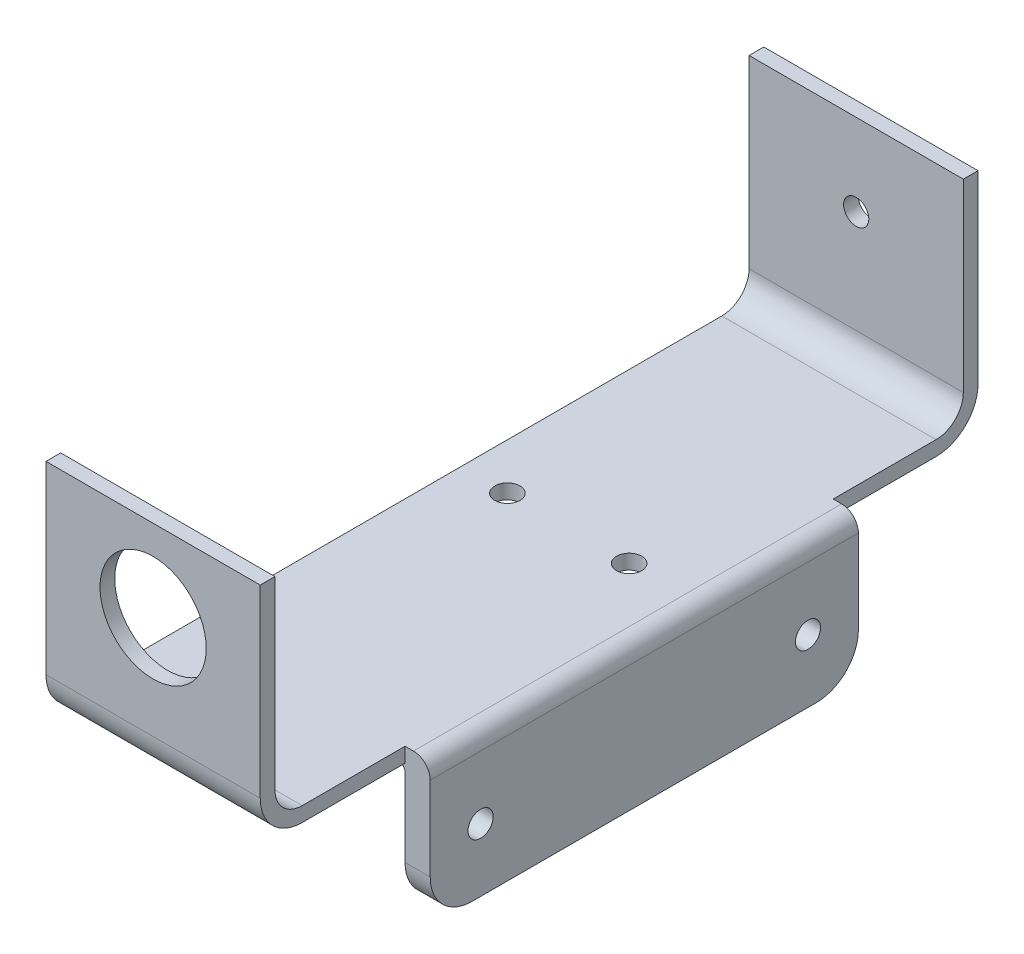
ISO-10303-21;
HEADER;
FILE_DESCRIPTION(('STEP AP214'),'2;1');
FILE_NAME('part.step','',(''),(''),'','','');
FILE_SCHEMA(('AUTOMOTIVE_DESIGN { 1 0 10303 214 1 1 1 1 }'));
ENDSEC;
DATA;
#1=APPLICATION_CONTEXT('core data for automotive mechanical design processes');
#2=APPLICATION_PROTOCOL_DEFINITION('international standard','automotive_design',2000,#1);
#3=PRODUCT_CONTEXT('',#1,'mechanical');
#4=PRODUCT('Part','Part','',(#3));
#5=PRODUCT_RELATED_PRODUCT_CATEGORY('part','',(#4));
#6=PRODUCT_DEFINITION_FORMATION('','',#4);
#7=PRODUCT_DEFINITION_CONTEXT('part definition',#1,'design');
#8=PRODUCT_DEFINITION('design','',#6,#7);
#9=PRODUCT_DEFINITION_SHAPE('','',#8);
#10=(LENGTH_UNIT() NAMED_UNIT(*) SI_UNIT(.MILLI.,.METRE.));
#11=(NAMED_UNIT(*) PLANE_ANGLE_UNIT() SI_UNIT($,.RADIAN.));
#12=(NAMED_UNIT(*) SI_UNIT($,.STERADIAN.) SOLID_ANGLE_UNIT());
#13=UNCERTAINTY_MEASURE_WITH_UNIT(LENGTH_MEASURE(1.E-05),#10,'distance_accuracy_value','');
#14=(GEOMETRIC_REPRESENTATION_CONTEXT(3) GLOBAL_UNCERTAINTY_ASSIGNED_CONTEXT((#13)) GLOBAL_UNIT_ASSIGNED_CONTEXT((#10,
#11,#12)) REPRESENTATION_CONTEXT('',''));
#15=CARTESIAN_POINT('',(0.,0.,0.));
#16=DIRECTION('',(0.,0.,1.));
#17=DIRECTION('',(1.,0.,0.));
#18=AXIS2_PLACEMENT_3D('',#15,#16,#17);
#19=CARTESIAN_POINT('',(25.52,5.,-5.));
#20=DIRECTION('',(1.,0.,0.));
#21=DIRECTION('',(0.,0.,-1.));
#22=AXIS2_PLACEMENT_3D('',#19,#20,#21);
#23=PLANE('',#22);
#24=DIRECTION('',(0.,0.,-1.));
#25=VECTOR('',#24,1.);
#26=CARTESIAN_POINT('',(25.52,0.,-5.00000000000004));
#27=LINE('',#26,#25);
#28=CARTESIAN_POINT('',(25.52,0.,-5.00000000000003));
#29=VERTEX_POINT('',#28);
#30=CARTESIAN_POINT('',(25.52,0.,-17.25));
#31=VERTEX_POINT('',#30);
#32=EDGE_CURVE('E323',#29,#31,#27,.T.);
#33=ORIENTED_EDGE('',*,*,#32,.T.);
#34=DIRECTION('',(0.,1.,0.));
#35=VECTOR('',#34,1.);
#36=CARTESIAN_POINT('',(25.52,-15.25,-17.25));
#37=LINE('',#36,#35);
#38=CARTESIAN_POINT('',(25.52,1.75,-17.25));
#39=VERTEX_POINT('',#38);
#40=EDGE_CURVE('E207',#31,#39,#37,.T.);
#41=ORIENTED_EDGE('',*,*,#40,.T.);
#42=DIRECTION('',(0.,0.,1.));
#43=VECTOR('',#42,1.);
#44=CARTESIAN_POINT('',(25.52,1.75,-5.00000000000002));
#45=LINE('',#44,#43);
#46=CARTESIAN_POINT('',(25.52,1.75,-5.00000000000002));
#47=VERTEX_POINT('',#46);
#48=EDGE_CURVE('E214',#39,#47,#45,.T.);
#49=ORIENTED_EDGE('',*,*,#48,.T.);
#50=CARTESIAN_POINT('',(25.52,5.,-5.));
#51=DIRECTION('',(-1.,0.,0.));
#52=DIRECTION('',(0.,0.,-1.));
#53=AXIS2_PLACEMENT_3D('',#50,#51,#52);
#54=CIRCLE('',#53,3.25);
#55=CARTESIAN_POINT('',(25.52,5.00000000000003,-1.75));
#56=VERTEX_POINT('',#55);
#57=EDGE_CURVE('E213',#47,#56,#54,.T.);
#58=ORIENTED_EDGE('',*,*,#57,.T.);
#59=DIRECTION('',(0.,1.,0.));
#60=VECTOR('',#59,1.);
#61=CARTESIAN_POINT('',(25.52,27.,-1.75));
#62=LINE('',#61,#60);
#63=CARTESIAN_POINT('',(25.52,27.,-1.75));
#64=VERTEX_POINT('',#63);
#65=EDGE_CURVE('E216',#56,#64,#62,.T.);
#66=ORIENTED_EDGE('',*,*,#65,.T.);
#67=DIRECTION('',(0.,0.,1.));
#68=VECTOR('',#67,1.);
#69=CARTESIAN_POINT('',(25.52,27.,0.));
#70=LINE('',#69,#68);
#71=CARTESIAN_POINT('',(25.52,27.,0.));
#72=VERTEX_POINT('',#71);
#73=EDGE_CURVE('E257',#64,#72,#70,.T.);
#74=ORIENTED_EDGE('',*,*,#73,.T.);
#75=DIRECTION('',(0.,-1.,0.));
#76=VECTOR('',#75,1.);
#77=CARTESIAN_POINT('',(25.52,27.,0.));
#78=LINE('',#77,#76);
#79=CARTESIAN_POINT('',(25.52,5.00000000000004,0.));
#80=VERTEX_POINT('',#79);
#81=EDGE_CURVE('E318',#72,#80,#78,.T.);
#82=ORIENTED_EDGE('',*,*,#81,.T.);
#83=CARTESIAN_POINT('',(25.52,5.,-5.));
#84=DIRECTION('',(1.,0.,0.));
#85=DIRECTION('',(0.,0.,-1.));
#86=AXIS2_PLACEMENT_3D('',#83,#84,#85);
#87=CIRCLE('',#86,5.);
#88=EDGE_CURVE('E320',#80,#29,#87,.T.);
#89=ORIENTED_EDGE('',*,*,#88,.T.);
#90=EDGE_LOOP('',(#33,#41,#49,#58,#66,#74,#82,#89));
#91=FACE_BOUND('',#90,.T.);
#92=ADVANCED_FACE('F33',(#91),#23,.T.);
#93=CARTESIAN_POINT('',(25.52,27.,0.));
#94=DIRECTION('',(0.,-1.,0.));
#95=DIRECTION('',(0.,0.,-1.));
#96=AXIS2_PLACEMENT_3D('',#93,#94,#95);
#97=PLANE('',#96);
#98=DIRECTION('',(0.,0.,1.));
#99=VECTOR('',#98,1.);
#100=CARTESIAN_POINT('',(0.,27.,0.));
#101=LINE('',#100,#99);
#102=CARTESIAN_POINT('',(0.,27.,-1.75));
#103=VERTEX_POINT('',#102);
#104=CARTESIAN_POINT('',(0.,27.,0.));
#105=VERTEX_POINT('',#104);
#106=EDGE_CURVE('E231',#103,#105,#101,.T.);
#107=ORIENTED_EDGE('',*,*,#106,.T.);
#108=DIRECTION('',(-1.,0.,0.));
#109=VECTOR('',#108,1.);
#110=CARTESIAN_POINT('',(25.52,27.,0.));
#111=LINE('',#110,#109);
#112=EDGE_CURVE('E288',#72,#105,#111,.T.);
#113=ORIENTED_EDGE('',*,*,#112,.F.);
#114=ORIENTED_EDGE('',*,*,#73,.F.);
#115=DIRECTION('',(-1.,0.,0.));
#116=VECTOR('',#115,1.);
#117=CARTESIAN_POINT('',(25.52,27.,-1.75));
#118=LINE('',#117,#116);
#119=EDGE_CURVE('E230',#64,#103,#118,.T.);
#120=ORIENTED_EDGE('',*,*,#119,.T.);
#121=EDGE_LOOP('',(#107,#113,#114,#120));
#122=FACE_BOUND('',#121,.T.);
#123=ADVANCED_FACE('F449',(#122),#97,.F.);
#124=CARTESIAN_POINT('',(25.52,27.,0.));
#125=DIRECTION('',(0.,0.,-1.));
#126=DIRECTION('',(0.,1.,0.));
#127=AXIS2_PLACEMENT_3D('',#124,#125,#126);
#128=PLANE('',#127);
#129=CARTESIAN_POINT('',(12.76,17.25,0.));
#130=DIRECTION('',(0.,0.,1.));
#131=DIRECTION('',(1.,0.,0.));
#132=AXIS2_PLACEMENT_3D('',#129,#130,#131);
#133=CIRCLE('',#132,6.325);
#134=CARTESIAN_POINT('',(19.085,17.25,0.));
#135=VERTEX_POINT('',#134);
#136=EDGE_CURVE('E311',#135,#135,#133,.T.);
#137=ORIENTED_EDGE('',*,*,#136,.F.);
#138=EDGE_LOOP('',(#137));
#139=FACE_BOUND('',#138,.T.);
#140=DIRECTION('',(0.,-1.,0.));
#141=VECTOR('',#140,1.);
#142=CARTESIAN_POINT('',(0.,27.,0.));
#143=LINE('',#142,#141);
#144=CARTESIAN_POINT('',(0.,5.00000000000004,0.));
#145=VERTEX_POINT('',#144);
#146=EDGE_CURVE('E234',#105,#145,#143,.T.);
#147=ORIENTED_EDGE('',*,*,#146,.T.);
#148=DIRECTION('',(-1.,0.,0.));
#149=VECTOR('',#148,1.);
#150=CARTESIAN_POINT('',(25.52,5.00000000000004,0.));
#151=LINE('',#150,#149);
#152=EDGE_CURVE('E286',#80,#145,#151,.T.);
#153=ORIENTED_EDGE('',*,*,#152,.F.);
#154=ORIENTED_EDGE('',*,*,#81,.F.);
#155=ORIENTED_EDGE('',*,*,#112,.T.);
#156=EDGE_LOOP('',(#147,#153,#154,#155));
#157=FACE_BOUND('',#156,.T.);
#158=ADVANCED_FACE('F447',(#139,#157),#128,.F.);
#159=CARTESIAN_POINT('',(25.52,5.,-5.));
#160=DIRECTION('',(-1.,0.,0.));
#161=DIRECTION('',(0.,0.,1.));
#162=AXIS2_PLACEMENT_3D('',#159,#160,#161);
#163=CYLINDRICAL_SURFACE('',#162,5.);
#164=CARTESIAN_POINT('',(0.,5.,-5.));
#165=DIRECTION('',(1.,0.,0.));
#166=DIRECTION('',(0.,0.,-1.));
#167=AXIS2_PLACEMENT_3D('',#164,#165,#166);
#168=CIRCLE('',#167,5.);
#169=CARTESIAN_POINT('',(0.,0.,-5.00000000000003));
#170=VERTEX_POINT('',#169);
#171=EDGE_CURVE('E237',#145,#170,#168,.T.);
#172=ORIENTED_EDGE('',*,*,#171,.T.);
#173=DIRECTION('',(-1.,0.,0.));
#174=VECTOR('',#173,1.);
#175=CARTESIAN_POINT('',(25.52,0.,-5.00000000000003));
#176=LINE('',#175,#174);
#177=EDGE_CURVE('E283',#29,#170,#176,.T.);
#178=ORIENTED_EDGE('',*,*,#177,.F.);
#179=ORIENTED_EDGE('',*,*,#88,.F.);
#180=ORIENTED_EDGE('',*,*,#152,.T.);
#181=EDGE_LOOP('',(#172,#178,#179,#180));
#182=FACE_BOUND('',#181,.T.);
#183=ADVANCED_FACE('F445',(#182),#163,.T.);
#184=CARTESIAN_POINT('',(25.52,0.,-5.00000000000004));
#185=DIRECTION('',(0.,1.,0.));
#186=DIRECTION('',(0.,0.,1.));
#187=AXIS2_PLACEMENT_3D('',#184,#185,#186);
#188=PLANE('',#187);
#189=CARTESIAN_POINT('',(5.51,0.,-49.45));
#190=DIRECTION('',(0.,1.,0.));
#191=DIRECTION('',(0.,0.,1.));
#192=AXIS2_PLACEMENT_3D('',#189,#190,#191);
#193=CIRCLE('',#192,1.5);
#194=CARTESIAN_POINT('',(5.51,0.,-47.95));
#195=VERTEX_POINT('',#194);
#196=EDGE_CURVE('E666',#195,#195,#193,.T.);
#197=ORIENTED_EDGE('',*,*,#196,.T.);
#198=EDGE_LOOP('',(#197));
#199=FACE_BOUND('',#198,.T.);
#200=CARTESIAN_POINT('',(20.01,0.,-49.45));
#201=DIRECTION('',(0.,1.,0.));
#202=DIRECTION('',(0.,0.,1.));
#203=AXIS2_PLACEMENT_3D('',#200,#201,#202);
#204=CIRCLE('',#203,1.5);
#205=CARTESIAN_POINT('',(20.01,0.,-47.95));
#206=VERTEX_POINT('',#205);
#207=EDGE_CURVE('E670',#206,#206,#204,.T.);
#208=ORIENTED_EDGE('',*,*,#207,.T.);
#209=EDGE_LOOP('',(#208));
#210=FACE_BOUND('',#209,.T.);
#211=CARTESIAN_POINT('',(25.52,0.,-68.25));
#212=VERTEX_POINT('',#211);
#213=CARTESIAN_POINT('',(25.52,0.,-80.5));
#214=VERTEX_POINT('',#213);
#215=EDGE_CURVE('E322',#212,#214,#27,.T.);
#216=ORIENTED_EDGE('',*,*,#215,.F.);
#217=DIRECTION('',(-1.,0.,0.));
#218=VECTOR('',#217,1.);
#219=CARTESIAN_POINT('',(25.52,0.,-68.25));
#220=LINE('',#219,#218);
#221=CARTESIAN_POINT('',(24.52,0.,-68.25));
#222=VERTEX_POINT('',#221);
#223=EDGE_CURVE('E204',#212,#222,#220,.T.);
#224=ORIENTED_EDGE('',*,*,#223,.T.);
#225=DIRECTION('',(0.,0.,-1.));
#226=VECTOR('',#225,1.);
#227=CARTESIAN_POINT('',(24.52,0.,-5.00000000000004));
#228=LINE('',#227,#226);
#229=CARTESIAN_POINT('',(24.52,0.,-17.25));
#230=VERTEX_POINT('',#229);
#231=EDGE_CURVE('E378',#222,#230,#228,.F.);
#232=ORIENTED_EDGE('',*,*,#231,.T.);
#233=DIRECTION('',(1.,0.,0.));
#234=VECTOR('',#233,1.);
#235=CARTESIAN_POINT('',(25.52,0.,-17.25));
#236=LINE('',#235,#234);
#237=EDGE_CURVE('E376',#230,#31,#236,.T.);
#238=ORIENTED_EDGE('',*,*,#237,.T.);
#239=ORIENTED_EDGE('',*,*,#32,.F.);
#240=ORIENTED_EDGE('',*,*,#177,.T.);
#241=DIRECTION('',(0.,0.,-1.));
#242=VECTOR('',#241,1.);
#243=CARTESIAN_POINT('',(0.,0.,-5.00000000000004));
#244=LINE('',#243,#242);
#245=CARTESIAN_POINT('',(0.,0.,-80.5));
#246=VERTEX_POINT('',#245);
#247=EDGE_CURVE('E239',#170,#246,#244,.T.);
#248=ORIENTED_EDGE('',*,*,#247,.T.);
#249=DIRECTION('',(-1.,0.,0.));
#250=VECTOR('',#249,1.);
#251=CARTESIAN_POINT('',(25.52,0.,-80.5));
#252=LINE('',#251,#250);
#253=EDGE_CURVE('E280',#214,#246,#252,.T.);
#254=ORIENTED_EDGE('',*,*,#253,.F.);
#255=EDGE_LOOP('',(#216,#224,#232,#238,#239,#240,#248,#254));
#256=FACE_BOUND('',#255,.T.);
#257=ADVANCED_FACE('F425',(#199,#210,#256),#188,.F.);
#258=CARTESIAN_POINT('',(25.52,5.,-80.5));
#259=DIRECTION('',(-1.,0.,0.));
#260=DIRECTION('',(0.,0.,1.));
#261=AXIS2_PLACEMENT_3D('',#258,#259,#260);
#262=CYLINDRICAL_SURFACE('',#261,5.);
#263=CARTESIAN_POINT('',(0.,5.,-80.5));
#264=DIRECTION('',(1.,0.,0.));
#265=DIRECTION('',(0.,0.,-1.));
#266=AXIS2_PLACEMENT_3D('',#263,#264,#265);
#267=CIRCLE('',#266,5.);
#268=CARTESIAN_POINT('',(0.,5.00000000000004,-85.5));
#269=VERTEX_POINT('',#268);
#270=EDGE_CURVE('E241',#246,#269,#267,.T.);
#271=ORIENTED_EDGE('',*,*,#270,.T.);
#272=DIRECTION('',(-1.,0.,0.));
#273=VECTOR('',#272,1.);
#274=CARTESIAN_POINT('',(25.52,5.00000000000004,-85.5));
#275=LINE('',#274,#273);
#276=CARTESIAN_POINT('',(25.52,5.00000000000004,-85.5));
#277=VERTEX_POINT('',#276);
#278=EDGE_CURVE('E277',#277,#269,#275,.T.);
#279=ORIENTED_EDGE('',*,*,#278,.F.);
#280=CARTESIAN_POINT('',(25.52,5.,-80.5));
#281=DIRECTION('',(1.,0.,0.));
#282=DIRECTION('',(0.,0.,-1.));
#283=AXIS2_PLACEMENT_3D('',#280,#281,#282);
#284=CIRCLE('',#283,5.);
#285=EDGE_CURVE('E325',#214,#277,#284,.T.);
#286=ORIENTED_EDGE('',*,*,#285,.F.);
#287=ORIENTED_EDGE('',*,*,#253,.T.);
#288=EDGE_LOOP('',(#271,#279,#286,#287));
#289=FACE_BOUND('',#288,.T.);
#290=ADVANCED_FACE('F432',(#289),#262,.T.);
#291=CARTESIAN_POINT('',(25.52,5.00000000000004,-85.5));
#292=DIRECTION('',(0.,0.,1.));
#293=DIRECTION('',(1.,0.,0.));
#294=AXIS2_PLACEMENT_3D('',#291,#292,#293);
#295=PLANE('',#294);
#296=CARTESIAN_POINT('',(12.76,17.25,-85.5));
#297=DIRECTION('',(0.,0.,-1.));
#298=DIRECTION('',(-1.,0.,0.));
#299=AXIS2_PLACEMENT_3D('',#296,#297,#298);
#300=CIRCLE('',#299,1.5);
#301=CARTESIAN_POINT('',(11.26,17.25,-85.5));
#302=VERTEX_POINT('',#301);
#303=EDGE_CURVE('E307',#302,#302,#300,.T.);
#304=ORIENTED_EDGE('',*,*,#303,.F.);
#305=EDGE_LOOP('',(#304));
#306=FACE_BOUND('',#305,.T.);
#307=DIRECTION('',(0.,1.,0.));
#308=VECTOR('',#307,1.);
#309=CARTESIAN_POINT('',(0.,5.00000000000004,-85.5));
#310=LINE('',#309,#308);
#311=CARTESIAN_POINT('',(0.,27.,-85.5));
#312=VERTEX_POINT('',#311);
#313=EDGE_CURVE('E243',#269,#312,#310,.T.);
#314=ORIENTED_EDGE('',*,*,#313,.T.);
#315=DIRECTION('',(-1.,0.,0.));
#316=VECTOR('',#315,1.);
#317=CARTESIAN_POINT('',(25.52,27.,-85.5));
#318=LINE('',#317,#316);
#319=CARTESIAN_POINT('',(25.52,27.,-85.5));
#320=VERTEX_POINT('',#319);
#321=EDGE_CURVE('E274',#320,#312,#318,.T.);
#322=ORIENTED_EDGE('',*,*,#321,.F.);
#323=DIRECTION('',(0.,1.,0.));
#324=VECTOR('',#323,1.);
#325=CARTESIAN_POINT('',(25.52,5.00000000000004,-85.5));
#326=LINE('',#325,#324);
#327=EDGE_CURVE('E327',#277,#320,#326,.T.);
#328=ORIENTED_EDGE('',*,*,#327,.F.);
#329=ORIENTED_EDGE('',*,*,#278,.T.);
#330=EDGE_LOOP('',(#314,#322,#328,#329));
#331=FACE_BOUND('',#330,.T.);
#332=ADVANCED_FACE('F436',(#306,#331),#295,.F.);
#333=CARTESIAN_POINT('',(25.52,27.,-83.75));
#334=DIRECTION('',(0.,-1.,0.));
#335=DIRECTION('',(0.,0.,-1.));
#336=AXIS2_PLACEMENT_3D('',#333,#334,#335);
#337=PLANE('',#336);
#338=DIRECTION('',(0.,0.,1.));
#339=VECTOR('',#338,1.);
#340=CARTESIAN_POINT('',(0.,27.,-83.75));
#341=LINE('',#340,#339);
#342=CARTESIAN_POINT('',(0.,27.,-83.75));
#343=VERTEX_POINT('',#342);
#344=EDGE_CURVE('E245',#312,#343,#341,.T.);
#345=ORIENTED_EDGE('',*,*,#344,.T.);
#346=DIRECTION('',(-1.,0.,0.));
#347=VECTOR('',#346,1.);
#348=CARTESIAN_POINT('',(25.52,27.,-83.75));
#349=LINE('',#348,#347);
#350=CARTESIAN_POINT('',(25.52,27.,-83.75));
#351=VERTEX_POINT('',#350);
#352=EDGE_CURVE('E271',#351,#343,#349,.T.);
#353=ORIENTED_EDGE('',*,*,#352,.F.);
#354=DIRECTION('',(0.,0.,1.));
#355=VECTOR('',#354,1.);
#356=CARTESIAN_POINT('',(25.52,27.,-83.75));
#357=LINE('',#356,#355);
#358=EDGE_CURVE('E329',#320,#351,#357,.T.);
#359=ORIENTED_EDGE('',*,*,#358,.F.);
#360=ORIENTED_EDGE('',*,*,#321,.T.);
#361=EDGE_LOOP('',(#345,#353,#359,#360));
#362=FACE_BOUND('',#361,.T.);
#363=ADVANCED_FACE('F439',(#362),#337,.F.);
#364=CARTESIAN_POINT('',(25.52,5.00000000000002,-83.75));
#365=DIRECTION('',(0.,0.,-1.));
#366=DIRECTION('',(-1.,0.,0.));
#367=AXIS2_PLACEMENT_3D('',#364,#365,#366);
#368=PLANE('',#367);
#369=CARTESIAN_POINT('',(12.76,17.25,-83.75));
#370=DIRECTION('',(0.,0.,-1.));
#371=DIRECTION('',(-1.,0.,0.));
#372=AXIS2_PLACEMENT_3D('',#369,#370,#371);
#373=CIRCLE('',#372,1.5);
#374=CARTESIAN_POINT('',(11.26,17.25,-83.75));
#375=VERTEX_POINT('',#374);
#376=EDGE_CURVE('E221',#375,#375,#373,.T.);
#377=ORIENTED_EDGE('',*,*,#376,.T.);
#378=EDGE_LOOP('',(#377));
#379=FACE_BOUND('',#378,.T.);
#380=DIRECTION('',(0.,-1.,0.));
#381=VECTOR('',#380,1.);
#382=CARTESIAN_POINT('',(0.,5.00000000000002,-83.75));
#383=LINE('',#382,#381);
#384=CARTESIAN_POINT('',(0.,5.00000000000002,-83.75));
#385=VERTEX_POINT('',#384);
#386=EDGE_CURVE('E247',#343,#385,#383,.T.);
#387=ORIENTED_EDGE('',*,*,#386,.T.);
#388=DIRECTION('',(-1.,0.,0.));
#389=VECTOR('',#388,1.);
#390=CARTESIAN_POINT('',(25.52,5.00000000000002,-83.75));
#391=LINE('',#390,#389);
#392=CARTESIAN_POINT('',(25.52,5.00000000000002,-83.75));
#393=VERTEX_POINT('',#392);
#394=EDGE_CURVE('E268',#393,#385,#391,.T.);
#395=ORIENTED_EDGE('',*,*,#394,.F.);
#396=DIRECTION('',(0.,-1.,0.));
#397=VECTOR('',#396,1.);
#398=CARTESIAN_POINT('',(25.52,5.00000000000002,-83.75));
#399=LINE('',#398,#397);
#400=EDGE_CURVE('E330',#351,#393,#399,.T.);
#401=ORIENTED_EDGE('',*,*,#400,.F.);
#402=ORIENTED_EDGE('',*,*,#352,.T.);
#403=EDGE_LOOP('',(#387,#395,#401,#402));
#404=FACE_BOUND('',#403,.T.);
#405=ADVANCED_FACE('F336',(#379,#404),#368,.F.);
#406=CARTESIAN_POINT('',(25.52,5.,-80.5));
#407=DIRECTION('',(-1.,0.,0.));
#408=DIRECTION('',(0.,0.,1.));
#409=AXIS2_PLACEMENT_3D('',#406,#407,#408);
#410=CYLINDRICAL_SURFACE('',#409,3.25);
#411=CARTESIAN_POINT('',(0.,5.,-80.5));
#412=DIRECTION('',(-1.,0.,0.));
#413=DIRECTION('',(0.,0.,-1.));
#414=AXIS2_PLACEMENT_3D('',#411,#412,#413);
#415=CIRCLE('',#414,3.25);
#416=CARTESIAN_POINT('',(0.,1.75,-80.5));
#417=VERTEX_POINT('',#416);
#418=EDGE_CURVE('E249',#385,#417,#415,.T.);
#419=ORIENTED_EDGE('',*,*,#418,.T.);
#420=DIRECTION('',(-1.,0.,0.));
#421=VECTOR('',#420,1.);
#422=CARTESIAN_POINT('',(25.52,1.75,-80.5));
#423=LINE('',#422,#421);
#424=CARTESIAN_POINT('',(25.52,1.75,-80.5));
#425=VERTEX_POINT('',#424);
#426=EDGE_CURVE('E266',#425,#417,#423,.T.);
#427=ORIENTED_EDGE('',*,*,#426,.F.);
#428=CARTESIAN_POINT('',(25.52,5.,-80.5));
#429=DIRECTION('',(-1.,0.,0.));
#430=DIRECTION('',(0.,0.,-1.));
#431=AXIS2_PLACEMENT_3D('',#428,#429,#430);
#432=CIRCLE('',#431,3.25);
#433=EDGE_CURVE('E211',#393,#425,#432,.T.);
#434=ORIENTED_EDGE('',*,*,#433,.F.);
#435=ORIENTED_EDGE('',*,*,#394,.T.);
#436=EDGE_LOOP('',(#419,#427,#434,#435));
#437=FACE_BOUND('',#436,.T.);
#438=ADVANCED_FACE('F340',(#437),#410,.F.);
#439=CARTESIAN_POINT('',(25.52,1.75,-5.00000000000002));
#440=DIRECTION('',(0.,-1.,0.));
#441=DIRECTION('',(0.,0.,-1.));
#442=AXIS2_PLACEMENT_3D('',#439,#440,#441);
#443=PLANE('',#442);
#444=CARTESIAN_POINT('',(5.51,1.75,-49.45));
#445=DIRECTION('',(0.,1.,0.));
#446=DIRECTION('',(0.,0.,1.));
#447=AXIS2_PLACEMENT_3D('',#444,#445,#446);
#448=CIRCLE('',#447,1.5);
#449=CARTESIAN_POINT('',(5.51,1.75,-47.95));
#450=VERTEX_POINT('',#449);
#451=EDGE_CURVE('E663',#450,#450,#448,.T.);
#452=ORIENTED_EDGE('',*,*,#451,.F.);
#453=EDGE_LOOP('',(#452));
#454=FACE_BOUND('',#453,.T.);
#455=CARTESIAN_POINT('',(20.01,1.75,-49.45));
#456=DIRECTION('',(0.,1.,0.));
#457=DIRECTION('',(0.,0.,1.));
#458=AXIS2_PLACEMENT_3D('',#455,#456,#457);
#459=CIRCLE('',#458,1.5);
#460=CARTESIAN_POINT('',(20.01,1.75,-47.95));
#461=VERTEX_POINT('',#460);
#462=EDGE_CURVE('E667',#461,#461,#459,.T.);
#463=ORIENTED_EDGE('',*,*,#462,.F.);
#464=EDGE_LOOP('',(#463));
#465=FACE_BOUND('',#464,.T.);
#466=DIRECTION('',(1.,0.,0.));
#467=VECTOR('',#466,1.);
#468=CARTESIAN_POINT('',(25.52,1.75,-17.25));
#469=LINE('',#468,#467);
#470=CARTESIAN_POINT('',(26.52,1.75,-17.25));
#471=VERTEX_POINT('',#470);
#472=EDGE_CURVE('E197',#39,#471,#469,.T.);
#473=ORIENTED_EDGE('',*,*,#472,.T.);
#474=DIRECTION('',(0.,0.,-1.));
#475=VECTOR('',#474,1.);
#476=CARTESIAN_POINT('',(26.52,1.75,-68.25));
#477=LINE('',#476,#475);
#478=CARTESIAN_POINT('',(26.52,1.75,-68.25));
#479=VERTEX_POINT('',#478);
#480=EDGE_CURVE('E193',#471,#479,#477,.T.);
#481=ORIENTED_EDGE('',*,*,#480,.T.);
#482=DIRECTION('',(-1.,0.,0.));
#483=VECTOR('',#482,1.);
#484=CARTESIAN_POINT('',(25.52,1.75,-68.25));
#485=LINE('',#484,#483);
#486=CARTESIAN_POINT('',(25.52,1.75,-68.25));
#487=VERTEX_POINT('',#486);
#488=EDGE_CURVE('E185',#479,#487,#485,.T.);
#489=ORIENTED_EDGE('',*,*,#488,.T.);
#490=EDGE_CURVE('E191',#425,#487,#45,.T.);
#491=ORIENTED_EDGE('',*,*,#490,.F.);
#492=ORIENTED_EDGE('',*,*,#426,.T.);
#493=DIRECTION('',(0.,0.,1.));
#494=VECTOR('',#493,1.);
#495=CARTESIAN_POINT('',(0.,1.75,-5.00000000000002));
#496=LINE('',#495,#494);
#497=CARTESIAN_POINT('',(0.,1.75,-5.00000000000002));
#498=VERTEX_POINT('',#497);
#499=EDGE_CURVE('E251',#417,#498,#496,.T.);
#500=ORIENTED_EDGE('',*,*,#499,.T.);
#501=DIRECTION('',(-1.,0.,0.));
#502=VECTOR('',#501,1.);
#503=CARTESIAN_POINT('',(25.52,1.75,-5.00000000000002));
#504=LINE('',#503,#502);
#505=EDGE_CURVE('E263',#47,#498,#504,.T.);
#506=ORIENTED_EDGE('',*,*,#505,.F.);
#507=ORIENTED_EDGE('',*,*,#48,.F.);
#508=EDGE_LOOP('',(#473,#481,#489,#491,#492,#500,#506,#507));
#509=FACE_BOUND('',#508,.T.);
#510=ADVANCED_FACE('F188',(#454,#465,#509),#443,.F.);
#511=CARTESIAN_POINT('',(25.52,5.,-5.));
#512=DIRECTION('',(-1.,0.,0.));
#513=DIRECTION('',(0.,0.,1.));
#514=AXIS2_PLACEMENT_3D('',#511,#512,#513);
#515=CYLINDRICAL_SURFACE('',#514,3.25);
#516=CARTESIAN_POINT('',(0.,5.,-5.));
#517=DIRECTION('',(-1.,0.,0.));
#518=DIRECTION('',(0.,0.,-1.));
#519=AXIS2_PLACEMENT_3D('',#516,#517,#518);
#520=CIRCLE('',#519,3.25);
#521=CARTESIAN_POINT('',(0.,5.00000000000003,-1.75));
#522=VERTEX_POINT('',#521);
#523=EDGE_CURVE('E253',#498,#522,#520,.T.);
#524=ORIENTED_EDGE('',*,*,#523,.T.);
#525=DIRECTION('',(-1.,0.,0.));
#526=VECTOR('',#525,1.);
#527=CARTESIAN_POINT('',(25.52,5.00000000000003,-1.75));
#528=LINE('',#527,#526);
#529=EDGE_CURVE('E260',#56,#522,#528,.T.);
#530=ORIENTED_EDGE('',*,*,#529,.F.);
#531=ORIENTED_EDGE('',*,*,#57,.F.);
#532=ORIENTED_EDGE('',*,*,#505,.T.);
#533=EDGE_LOOP('',(#524,#530,#531,#532));
#534=FACE_BOUND('',#533,.T.);
#535=ADVANCED_FACE('F350',(#534),#515,.F.);
#536=CARTESIAN_POINT('',(25.52,27.,-1.75));
#537=DIRECTION('',(0.,0.,1.));
#538=DIRECTION('',(1.,0.,0.));
#539=AXIS2_PLACEMENT_3D('',#536,#537,#538);
#540=PLANE('',#539);
#541=CARTESIAN_POINT('',(12.76,17.25,-1.75000000000001));
#542=DIRECTION('',(0.,0.,1.));
#543=DIRECTION('',(1.,0.,0.));
#544=AXIS2_PLACEMENT_3D('',#541,#542,#543);
#545=CIRCLE('',#544,6.325);
#546=CARTESIAN_POINT('',(19.085,17.25,-1.75000000000001));
#547=VERTEX_POINT('',#546);
#548=EDGE_CURVE('E235',#547,#547,#545,.F.);
#549=ORIENTED_EDGE('',*,*,#548,.F.);
#550=EDGE_LOOP('',(#549));
#551=FACE_BOUND('',#550,.T.);
#552=DIRECTION('',(0.,1.,0.));
#553=VECTOR('',#552,1.);
#554=CARTESIAN_POINT('',(0.,27.,-1.75));
#555=LINE('',#554,#553);
#556=EDGE_CURVE('E255',#522,#103,#555,.T.);
#557=ORIENTED_EDGE('',*,*,#556,.T.);
#558=ORIENTED_EDGE('',*,*,#119,.F.);
#559=ORIENTED_EDGE('',*,*,#65,.F.);
#560=ORIENTED_EDGE('',*,*,#529,.T.);
#561=EDGE_LOOP('',(#557,#558,#559,#560));
#562=FACE_BOUND('',#561,.T.);
#563=ADVANCED_FACE('F354',(#551,#562),#540,.F.);
#564=DIRECTION('',(0.,1.,0.));
#565=VECTOR('',#564,1.);
#566=CARTESIAN_POINT('',(25.52,-15.25,-68.25));
#567=LINE('',#566,#565);
#568=EDGE_CURVE('E200',#212,#487,#567,.T.);
#569=ORIENTED_EDGE('',*,*,#568,.F.);
#570=ORIENTED_EDGE('',*,*,#215,.T.);
#571=ORIENTED_EDGE('',*,*,#285,.T.);
#572=ORIENTED_EDGE('',*,*,#327,.T.);
#573=ORIENTED_EDGE('',*,*,#358,.T.);
#574=ORIENTED_EDGE('',*,*,#400,.T.);
#575=ORIENTED_EDGE('',*,*,#433,.T.);
#576=ORIENTED_EDGE('',*,*,#490,.T.);
#577=EDGE_LOOP('',(#569,#570,#571,#572,#573,#574,#575,#576));
#578=FACE_BOUND('',#577,.T.);
#579=ADVANCED_FACE('F209',(#578),#23,.T.);
#580=CARTESIAN_POINT('',(0.,5.,-5.));
#581=DIRECTION('',(1.,0.,0.));
#582=DIRECTION('',(0.,0.,-1.));
#583=AXIS2_PLACEMENT_3D('',#580,#581,#582);
#584=PLANE('',#583);
#585=ORIENTED_EDGE('',*,*,#106,.F.);
#586=ORIENTED_EDGE('',*,*,#556,.F.);
#587=ORIENTED_EDGE('',*,*,#523,.F.);
#588=ORIENTED_EDGE('',*,*,#499,.F.);
#589=ORIENTED_EDGE('',*,*,#418,.F.);
#590=ORIENTED_EDGE('',*,*,#386,.F.);
#591=ORIENTED_EDGE('',*,*,#344,.F.);
#592=ORIENTED_EDGE('',*,*,#313,.F.);
#593=ORIENTED_EDGE('',*,*,#270,.F.);
#594=ORIENTED_EDGE('',*,*,#247,.F.);
#595=ORIENTED_EDGE('',*,*,#171,.F.);
#596=ORIENTED_EDGE('',*,*,#146,.F.);
#597=EDGE_LOOP('',(#585,#586,#587,#588,#589,#590,#591,#592,#593,#594,#595,#596));
#598=FACE_BOUND('',#597,.T.);
#599=ADVANCED_FACE('F346',(#598),#584,.F.);
#600=CARTESIAN_POINT('',(12.76,17.25,-19.6398015640197));
#601=DIRECTION('',(0.,0.,1.));
#602=DIRECTION('',(1.,0.,0.));
#603=AXIS2_PLACEMENT_3D('',#600,#601,#602);
#604=CYLINDRICAL_SURFACE('',#603,6.325);
#605=ORIENTED_EDGE('',*,*,#548,.T.);
#606=EDGE_LOOP('',(#605));
#607=FACE_BOUND('',#606,.T.);
#608=ORIENTED_EDGE('',*,*,#136,.T.);
#609=EDGE_LOOP('',(#608));
#610=FACE_BOUND('',#609,.T.);
#611=ADVANCED_FACE('F499',(#607,#610),#604,.F.);
#612=CARTESIAN_POINT('',(12.76,17.25,-59.98));
#613=DIRECTION('',(0.,0.,-1.));
#614=DIRECTION('',(-1.,0.,0.));
#615=AXIS2_PLACEMENT_3D('',#612,#613,#614);
#616=CYLINDRICAL_SURFACE('',#615,1.5);
#617=ORIENTED_EDGE('',*,*,#303,.T.);
#618=EDGE_LOOP('',(#617));
#619=FACE_BOUND('',#618,.T.);
#620=ORIENTED_EDGE('',*,*,#376,.F.);
#621=EDGE_LOOP('',(#620));
#622=FACE_BOUND('',#621,.T.);
#623=ADVANCED_FACE('F495',(#619,#622),#616,.F.);
#624=CARTESIAN_POINT('',(25.52,-15.25,-68.25));
#625=DIRECTION('',(-1.,0.,0.));
#626=DIRECTION('',(0.,0.,1.));
#627=AXIS2_PLACEMENT_3D('',#624,#625,#626);
#628=PLANE('',#627);
#629=CARTESIAN_POINT('',(25.52,-7.75,-62.25));
#630=DIRECTION('',(-1.,0.,0.));
#631=DIRECTION('',(0.,0.,1.));
#632=AXIS2_PLACEMENT_3D('',#629,#630,#631);
#633=CIRCLE('',#632,1.49999999999999);
#634=CARTESIAN_POINT('',(25.52,-7.75,-60.75));
#635=VERTEX_POINT('',#634);
#636=EDGE_CURVE('E679',#635,#635,#633,.T.);
#637=ORIENTED_EDGE('',*,*,#636,.F.);
#638=EDGE_LOOP('',(#637));
#639=FACE_BOUND('',#638,.T.);
#640=CARTESIAN_POINT('',(25.52,-7.75,-23.25));
#641=DIRECTION('',(-1.,0.,0.));
#642=DIRECTION('',(0.,0.,1.));
#643=AXIS2_PLACEMENT_3D('',#640,#641,#642);
#644=CIRCLE('',#643,1.5);
#645=CARTESIAN_POINT('',(25.52,-7.75,-21.75));
#646=VERTEX_POINT('',#645);
#647=EDGE_CURVE('E358',#646,#646,#644,.T.);
#648=ORIENTED_EDGE('',*,*,#647,.F.);
#649=EDGE_LOOP('',(#648));
#650=FACE_BOUND('',#649,.T.);
#651=CARTESIAN_POINT('',(25.52,-10.25,-68.25));
#652=VERTEX_POINT('',#651);
#653=CARTESIAN_POINT('',(25.52,-0.999999999999999,-68.25));
#654=VERTEX_POINT('',#653);
#655=EDGE_CURVE('E310',#652,#654,#567,.T.);
#656=ORIENTED_EDGE('',*,*,#655,.F.);
#657=CARTESIAN_POINT('',(25.52,-10.25,-63.25));
#658=DIRECTION('',(-1.,0.,0.));
#659=DIRECTION('',(0.,0.,1.));
#660=AXIS2_PLACEMENT_3D('',#657,#658,#659);
#661=CIRCLE('',#660,5.);
#662=CARTESIAN_POINT('',(25.52,-15.25,-63.25));
#663=VERTEX_POINT('',#662);
#664=EDGE_CURVE('E392',#652,#663,#661,.T.);
#665=ORIENTED_EDGE('',*,*,#664,.T.);
#666=DIRECTION('',(0.,0.,1.));
#667=VECTOR('',#666,1.);
#668=CARTESIAN_POINT('',(25.52,-15.25,-68.25));
#669=LINE('',#668,#667);
#670=CARTESIAN_POINT('',(25.52,-15.25,-22.25));
#671=VERTEX_POINT('',#670);
#672=EDGE_CURVE('E196',#663,#671,#669,.T.);
#673=ORIENTED_EDGE('',*,*,#672,.T.);
#674=CARTESIAN_POINT('',(25.52,-10.25,-22.25));
#675=DIRECTION('',(-1.,0.,0.));
#676=DIRECTION('',(0.,0.,1.));
#677=AXIS2_PLACEMENT_3D('',#674,#675,#676);
#678=CIRCLE('',#677,5.);
#679=CARTESIAN_POINT('',(25.52,-10.25,-17.25));
#680=VERTEX_POINT('',#679);
#681=EDGE_CURVE('E390',#671,#680,#678,.T.);
#682=ORIENTED_EDGE('',*,*,#681,.T.);
#683=CARTESIAN_POINT('',(25.52,-0.999999999999999,-17.25));
#684=VERTEX_POINT('',#683);
#685=EDGE_CURVE('E300',#680,#684,#37,.T.);
#686=ORIENTED_EDGE('',*,*,#685,.T.);
#687=DIRECTION('',(0.,0.,-1.));
#688=VECTOR('',#687,1.);
#689=CARTESIAN_POINT('',(25.52,-0.999999999999999,-68.25));
#690=LINE('',#689,#688);
#691=EDGE_CURVE('E373',#684,#654,#690,.T.);
#692=ORIENTED_EDGE('',*,*,#691,.T.);
#693=EDGE_LOOP('',(#656,#665,#673,#682,#686,#692));
#694=FACE_BOUND('',#693,.T.);
#695=ADVANCED_FACE('F407',(#639,#650,#694),#628,.T.);
#696=CARTESIAN_POINT('',(25.52,-15.25,-68.25));
#697=DIRECTION('',(0.,0.,-1.));
#698=DIRECTION('',(0.,1.,0.));
#699=AXIS2_PLACEMENT_3D('',#696,#697,#698);
#700=PLANE('',#699);
#701=DIRECTION('',(0.,1.,0.));
#702=VECTOR('',#701,1.);
#703=CARTESIAN_POINT('',(28.52,-15.25,-68.25));
#704=LINE('',#703,#702);
#705=CARTESIAN_POINT('',(28.52,-10.25,-68.25));
#706=VERTEX_POINT('',#705);
#707=CARTESIAN_POINT('',(28.52,-0.25,-68.25));
#708=VERTEX_POINT('',#707);
#709=EDGE_CURVE('E400',#706,#708,#704,.T.);
#710=ORIENTED_EDGE('',*,*,#709,.F.);
#711=DIRECTION('',(-1.,0.,0.));
#712=VECTOR('',#711,1.);
#713=CARTESIAN_POINT('',(25.52,-10.25,-68.25));
#714=LINE('',#713,#712);
#715=EDGE_CURVE('E387',#706,#652,#714,.T.);
#716=ORIENTED_EDGE('',*,*,#715,.T.);
#717=ORIENTED_EDGE('',*,*,#655,.T.);
#718=CARTESIAN_POINT('',(24.52,-0.999999999999999,-68.25));
#719=DIRECTION('',(0.,0.,-1.));
#720=DIRECTION('',(0.,1.,0.));
#721=AXIS2_PLACEMENT_3D('',#718,#719,#720);
#722=CIRCLE('',#721,1.);
#723=EDGE_CURVE('E382',#654,#222,#722,.F.);
#724=ORIENTED_EDGE('',*,*,#723,.T.);
#725=ORIENTED_EDGE('',*,*,#223,.F.);
#726=ORIENTED_EDGE('',*,*,#568,.T.);
#727=ORIENTED_EDGE('',*,*,#488,.F.);
#728=CARTESIAN_POINT('',(26.52,-0.25,-68.25));
#729=DIRECTION('',(0.,0.,-1.));
#730=DIRECTION('',(0.,1.,0.));
#731=AXIS2_PLACEMENT_3D('',#728,#729,#730);
#732=CIRCLE('',#731,2.);
#733=EDGE_CURVE('E364',#479,#708,#732,.T.);
#734=ORIENTED_EDGE('',*,*,#733,.T.);
#735=EDGE_LOOP('',(#710,#716,#717,#724,#725,#726,#727,#734));
#736=FACE_BOUND('',#735,.T.);
#737=ADVANCED_FACE('F202',(#736),#700,.T.);
#738=CARTESIAN_POINT('',(28.52,-15.25,-68.25));
#739=DIRECTION('',(1.,0.,0.));
#740=DIRECTION('',(0.,0.,-1.));
#741=AXIS2_PLACEMENT_3D('',#738,#739,#740);
#742=PLANE('',#741);
#743=CARTESIAN_POINT('',(28.52,-7.75,-62.25));
#744=DIRECTION('',(1.,0.,0.));
#745=DIRECTION('',(0.,0.,-1.));
#746=AXIS2_PLACEMENT_3D('',#743,#744,#745);
#747=CIRCLE('',#746,1.49999999999999);
#748=CARTESIAN_POINT('',(28.52,-7.75,-63.75));
#749=VERTEX_POINT('',#748);
#750=EDGE_CURVE('E676',#749,#749,#747,.T.);
#751=ORIENTED_EDGE('',*,*,#750,.F.);
#752=EDGE_LOOP('',(#751));
#753=FACE_BOUND('',#752,.T.);
#754=CARTESIAN_POINT('',(28.52,-7.75,-23.25));
#755=DIRECTION('',(1.,0.,0.));
#756=DIRECTION('',(0.,0.,-1.));
#757=AXIS2_PLACEMENT_3D('',#754,#755,#756);
#758=CIRCLE('',#757,1.5);
#759=CARTESIAN_POINT('',(28.52,-7.75,-24.75));
#760=VERTEX_POINT('',#759);
#761=EDGE_CURVE('E680',#760,#760,#758,.T.);
#762=ORIENTED_EDGE('',*,*,#761,.F.);
#763=EDGE_LOOP('',(#762));
#764=FACE_BOUND('',#763,.T.);
#765=DIRECTION('',(0.,0.,-1.));
#766=VECTOR('',#765,1.);
#767=CARTESIAN_POINT('',(28.52,-15.25,-68.25));
#768=LINE('',#767,#766);
#769=CARTESIAN_POINT('',(28.52,-15.25,-22.25));
#770=VERTEX_POINT('',#769);
#771=CARTESIAN_POINT('',(28.52,-15.25,-63.25));
#772=VERTEX_POINT('',#771);
#773=EDGE_CURVE('E305',#770,#772,#768,.T.);
#774=ORIENTED_EDGE('',*,*,#773,.T.);
#775=CARTESIAN_POINT('',(28.52,-10.25,-63.25));
#776=DIRECTION('',(1.,0.,0.));
#777=DIRECTION('',(0.,0.,-1.));
#778=AXIS2_PLACEMENT_3D('',#775,#776,#777);
#779=CIRCLE('',#778,5.);
#780=EDGE_CURVE('E41',#772,#706,#779,.T.);
#781=ORIENTED_EDGE('',*,*,#780,.T.);
#782=ORIENTED_EDGE('',*,*,#709,.T.);
#783=DIRECTION('',(0.,0.,-1.));
#784=VECTOR('',#783,1.);
#785=CARTESIAN_POINT('',(28.52,-0.25,-17.25));
#786=LINE('',#785,#784);
#787=CARTESIAN_POINT('',(28.52,-0.25,-17.25));
#788=VERTEX_POINT('',#787);
#789=EDGE_CURVE('E366',#708,#788,#786,.F.);
#790=ORIENTED_EDGE('',*,*,#789,.T.);
#791=DIRECTION('',(0.,1.,0.));
#792=VECTOR('',#791,1.);
#793=CARTESIAN_POINT('',(28.52,-15.25,-17.25));
#794=LINE('',#793,#792);
#795=CARTESIAN_POINT('',(28.52,-10.25,-17.25));
#796=VERTEX_POINT('',#795);
#797=EDGE_CURVE('E304',#796,#788,#794,.T.);
#798=ORIENTED_EDGE('',*,*,#797,.F.);
#799=CARTESIAN_POINT('',(28.52,-10.25,-22.25));
#800=DIRECTION('',(1.,0.,0.));
#801=DIRECTION('',(0.,0.,-1.));
#802=AXIS2_PLACEMENT_3D('',#799,#800,#801);
#803=CIRCLE('',#802,5.);
#804=EDGE_CURVE('E48',#796,#770,#803,.T.);
#805=ORIENTED_EDGE('',*,*,#804,.T.);
#806=EDGE_LOOP('',(#774,#781,#782,#790,#798,#805));
#807=FACE_BOUND('',#806,.T.);
#808=ADVANCED_FACE('F399',(#753,#764,#807),#742,.T.);
#809=CARTESIAN_POINT('',(25.52,-15.25,-17.25));
#810=DIRECTION('',(0.,0.,1.));
#811=DIRECTION('',(0.,-1.,0.));
#812=AXIS2_PLACEMENT_3D('',#809,#810,#811);
#813=PLANE('',#812);
#814=ORIENTED_EDGE('',*,*,#685,.F.);
#815=DIRECTION('',(1.,0.,0.));
#816=VECTOR('',#815,1.);
#817=CARTESIAN_POINT('',(28.52,-10.25,-17.25));
#818=LINE('',#817,#816);
#819=EDGE_CURVE('E11',#680,#796,#818,.T.);
#820=ORIENTED_EDGE('',*,*,#819,.T.);
#821=ORIENTED_EDGE('',*,*,#797,.T.);
#822=CARTESIAN_POINT('',(26.52,-0.25,-17.25));
#823=DIRECTION('',(0.,0.,1.));
#824=DIRECTION('',(0.,-1.,0.));
#825=AXIS2_PLACEMENT_3D('',#822,#823,#824);
#826=CIRCLE('',#825,2.);
#827=EDGE_CURVE('E363',#788,#471,#826,.T.);
#828=ORIENTED_EDGE('',*,*,#827,.T.);
#829=ORIENTED_EDGE('',*,*,#472,.F.);
#830=ORIENTED_EDGE('',*,*,#40,.F.);
#831=ORIENTED_EDGE('',*,*,#237,.F.);
#832=CARTESIAN_POINT('',(24.52,-0.999999999999999,-17.25));
#833=DIRECTION('',(0.,0.,1.));
#834=DIRECTION('',(0.,-1.,0.));
#835=AXIS2_PLACEMENT_3D('',#832,#833,#834);
#836=CIRCLE('',#835,1.);
#837=EDGE_CURVE('E384',#230,#684,#836,.F.);
#838=ORIENTED_EDGE('',*,*,#837,.T.);
#839=EDGE_LOOP('',(#814,#820,#821,#828,#829,#830,#831,#838));
#840=FACE_BOUND('',#839,.T.);
#841=ADVANCED_FACE('F422',(#840),#813,.T.);
#842=CARTESIAN_POINT('',(0.,-15.25,0.));
#843=DIRECTION('',(0.,1.,0.));
#844=DIRECTION('',(0.,0.,1.));
#845=AXIS2_PLACEMENT_3D('',#842,#843,#844);
#846=PLANE('',#845);
#847=ORIENTED_EDGE('',*,*,#672,.F.);
#848=DIRECTION('',(-1.,0.,0.));
#849=VECTOR('',#848,1.);
#850=CARTESIAN_POINT('',(28.52,-15.25,-63.25));
#851=LINE('',#850,#849);
#852=EDGE_CURVE('E55',#663,#772,#851,.F.);
#853=ORIENTED_EDGE('',*,*,#852,.T.);
#854=ORIENTED_EDGE('',*,*,#773,.F.);
#855=DIRECTION('',(1.,0.,0.));
#856=VECTOR('',#855,1.);
#857=CARTESIAN_POINT('',(25.52,-15.25,-22.25));
#858=LINE('',#857,#856);
#859=EDGE_CURVE('E394',#770,#671,#858,.F.);
#860=ORIENTED_EDGE('',*,*,#859,.T.);
#861=EDGE_LOOP('',(#847,#853,#854,#860));
#862=FACE_BOUND('',#861,.T.);
#863=ADVANCED_FACE('F409',(#862),#846,.F.);
#864=CARTESIAN_POINT('',(26.52,-0.25,-5.00000000000002));
#865=DIRECTION('',(0.,0.,1.));
#866=DIRECTION('',(1.,0.,0.));
#867=AXIS2_PLACEMENT_3D('',#864,#865,#866);
#868=CYLINDRICAL_SURFACE('',#867,2.);
#869=ORIENTED_EDGE('',*,*,#827,.F.);
#870=ORIENTED_EDGE('',*,*,#789,.F.);
#871=ORIENTED_EDGE('',*,*,#733,.F.);
#872=ORIENTED_EDGE('',*,*,#480,.F.);
#873=EDGE_LOOP('',(#869,#870,#871,#872));
#874=FACE_BOUND('',#873,.T.);
#875=ADVANCED_FACE('F361',(#874),#868,.T.);
#876=CARTESIAN_POINT('',(24.52,-0.999999999999999,-68.25));
#877=DIRECTION('',(0.,0.,-1.));
#878=DIRECTION('',(-1.,0.,0.));
#879=AXIS2_PLACEMENT_3D('',#876,#877,#878);
#880=CYLINDRICAL_SURFACE('',#879,1.);
#881=ORIENTED_EDGE('',*,*,#837,.F.);
#882=ORIENTED_EDGE('',*,*,#231,.F.);
#883=ORIENTED_EDGE('',*,*,#723,.F.);
#884=ORIENTED_EDGE('',*,*,#691,.F.);
#885=EDGE_LOOP('',(#881,#882,#883,#884));
#886=FACE_BOUND('',#885,.T.);
#887=ADVANCED_FACE('F420',(#886),#880,.F.);
#888=CARTESIAN_POINT('',(0.,-7.75,-23.25));
#889=DIRECTION('',(1.,0.,0.));
#890=DIRECTION('',(0.,0.,-1.));
#891=AXIS2_PLACEMENT_3D('',#888,#889,#890);
#892=CYLINDRICAL_SURFACE('',#891,1.5);
#893=ORIENTED_EDGE('',*,*,#647,.T.);
#894=EDGE_LOOP('',(#893));
#895=FACE_BOUND('',#894,.T.);
#896=ORIENTED_EDGE('',*,*,#761,.T.);
#897=EDGE_LOOP('',(#896));
#898=FACE_BOUND('',#897,.T.);
#899=ADVANCED_FACE('F464',(#895,#898),#892,.F.);
#900=CARTESIAN_POINT('',(0.,-7.75,-62.25));
#901=DIRECTION('',(1.,0.,0.));
#902=DIRECTION('',(0.,0.,-1.));
#903=AXIS2_PLACEMENT_3D('',#900,#901,#902);
#904=CYLINDRICAL_SURFACE('',#903,1.49999999999999);
#905=ORIENTED_EDGE('',*,*,#636,.T.);
#906=EDGE_LOOP('',(#905));
#907=FACE_BOUND('',#906,.T.);
#908=ORIENTED_EDGE('',*,*,#750,.T.);
#909=EDGE_LOOP('',(#908));
#910=FACE_BOUND('',#909,.T.);
#911=ADVANCED_FACE('F466',(#907,#910),#904,.F.);
#912=CARTESIAN_POINT('',(25.52,-10.25,-63.25));
#913=DIRECTION('',(1.,0.,0.));
#914=DIRECTION('',(0.,0.,-1.));
#915=AXIS2_PLACEMENT_3D('',#912,#913,#914);
#916=CYLINDRICAL_SURFACE('',#915,5.);
#917=ORIENTED_EDGE('',*,*,#780,.F.);
#918=ORIENTED_EDGE('',*,*,#852,.F.);
#919=ORIENTED_EDGE('',*,*,#664,.F.);
#920=ORIENTED_EDGE('',*,*,#715,.F.);
#921=EDGE_LOOP('',(#917,#918,#919,#920));
#922=FACE_BOUND('',#921,.T.);
#923=ADVANCED_FACE('F404',(#922),#916,.T.);
#924=CARTESIAN_POINT('',(25.52,-10.25,-22.25));
#925=DIRECTION('',(-1.,0.,0.));
#926=DIRECTION('',(0.,0.,1.));
#927=AXIS2_PLACEMENT_3D('',#924,#925,#926);
#928=CYLINDRICAL_SURFACE('',#927,5.);
#929=ORIENTED_EDGE('',*,*,#681,.F.);
#930=ORIENTED_EDGE('',*,*,#859,.F.);
#931=ORIENTED_EDGE('',*,*,#804,.F.);
#932=ORIENTED_EDGE('',*,*,#819,.F.);
#933=EDGE_LOOP('',(#929,#930,#931,#932));
#934=FACE_BOUND('',#933,.T.);
#935=ADVANCED_FACE('F35',(#934),#928,.T.);
#936=CARTESIAN_POINT('',(20.01,-15.25,-49.45));
#937=DIRECTION('',(0.,1.,0.));
#938=DIRECTION('',(0.,0.,1.));
#939=AXIS2_PLACEMENT_3D('',#936,#937,#938);
#940=CYLINDRICAL_SURFACE('',#939,1.5);
#941=ORIENTED_EDGE('',*,*,#462,.T.);
#942=EDGE_LOOP('',(#941));
#943=FACE_BOUND('',#942,.T.);
#944=ORIENTED_EDGE('',*,*,#207,.F.);
#945=EDGE_LOOP('',(#944));
#946=FACE_BOUND('',#945,.T.);
#947=ADVANCED_FACE('F471',(#943,#946),#940,.F.);
#948=CARTESIAN_POINT('',(5.51,-15.25,-49.45));
#949=DIRECTION('',(0.,1.,0.));
#950=DIRECTION('',(0.,0.,1.));
#951=AXIS2_PLACEMENT_3D('',#948,#949,#950);
#952=CYLINDRICAL_SURFACE('',#951,1.5);
#953=ORIENTED_EDGE('',*,*,#451,.T.);
#954=EDGE_LOOP('',(#953));
#955=FACE_BOUND('',#954,.T.);
#956=ORIENTED_EDGE('',*,*,#196,.F.);
#957=EDGE_LOOP('',(#956));
#958=FACE_BOUND('',#957,.T.);
#959=ADVANCED_FACE('F648',(#955,#958),#952,.F.);
#960=CLOSED_SHELL('',(#92,#123,#158,#183,#257,#290,#332,#363,#405,#438,#510,#535,#563,#579,#599,
#611,#623,#695,#737,#808,#841,#863,#875,#887,#899,#911,#923,#935,#947,#959));
#961=MANIFOLD_SOLID_BREP('B2',#960);
#962=ADVANCED_BREP_SHAPE_REPRESENTATION('',(#18,#961),#14);
#963=SHAPE_DEFINITION_REPRESENTATION(#9,#962);
ENDSEC;
END-ISO-10303-21;
